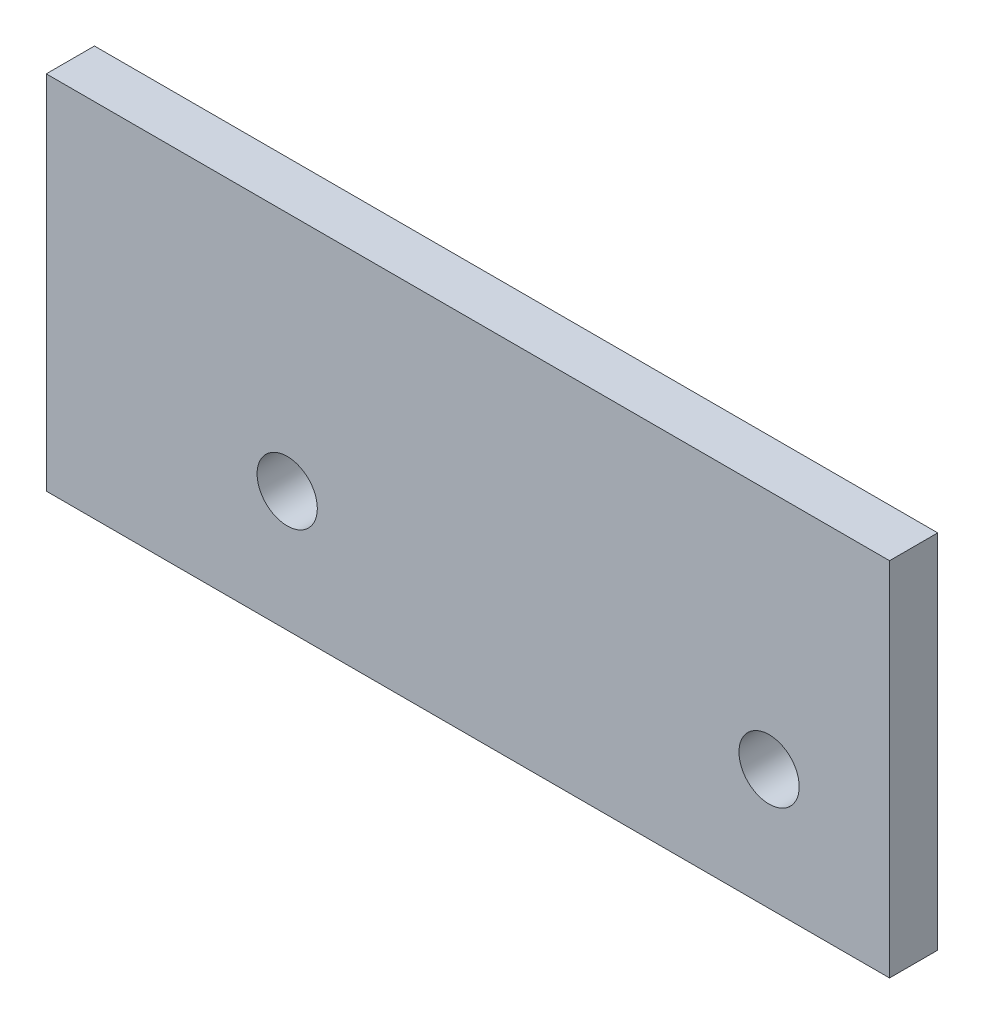
ISO-10303-21;
HEADER;
FILE_DESCRIPTION(('STEP AP214'),'2;1');
FILE_NAME('part.step','',(''),(''),'','','');
FILE_SCHEMA(('AUTOMOTIVE_DESIGN { 1 0 10303 214 1 1 1 1 }'));
ENDSEC;
DATA;
#1=APPLICATION_CONTEXT('core data for automotive mechanical design processes');
#2=APPLICATION_PROTOCOL_DEFINITION('international standard','automotive_design',2000,#1);
#3=PRODUCT_CONTEXT('',#1,'mechanical');
#4=PRODUCT('Part','Part','',(#3));
#5=PRODUCT_RELATED_PRODUCT_CATEGORY('part','',(#4));
#6=PRODUCT_DEFINITION_FORMATION('','',#4);
#7=PRODUCT_DEFINITION_CONTEXT('part definition',#1,'design');
#8=PRODUCT_DEFINITION('design','',#6,#7);
#9=PRODUCT_DEFINITION_SHAPE('','',#8);
#10=(LENGTH_UNIT() NAMED_UNIT(*) SI_UNIT(.MILLI.,.METRE.));
#11=(NAMED_UNIT(*) PLANE_ANGLE_UNIT() SI_UNIT($,.RADIAN.));
#12=(NAMED_UNIT(*) SI_UNIT($,.STERADIAN.) SOLID_ANGLE_UNIT());
#13=UNCERTAINTY_MEASURE_WITH_UNIT(LENGTH_MEASURE(1.E-05),#10,'distance_accuracy_value','');
#14=(GEOMETRIC_REPRESENTATION_CONTEXT(3) GLOBAL_UNCERTAINTY_ASSIGNED_CONTEXT((#13)) GLOBAL_UNIT_ASSIGNED_CONTEXT((#10,
#11,#12)) REPRESENTATION_CONTEXT('',''));
#15=CARTESIAN_POINT('',(0.,0.,0.));
#16=DIRECTION('',(0.,0.,1.));
#17=DIRECTION('',(1.,0.,0.));
#18=AXIS2_PLACEMENT_3D('',#15,#16,#17);
#19=CARTESIAN_POINT('',(50.,0.,-4.));
#20=DIRECTION('',(-1.,0.,0.));
#21=DIRECTION('',(0.,0.,1.));
#22=AXIS2_PLACEMENT_3D('',#19,#20,#21);
#23=PLANE('',#22);
#24=DIRECTION('',(0.,-1.,0.));
#25=VECTOR('',#24,1.);
#26=CARTESIAN_POINT('',(50.,0.,0.));
#27=LINE('',#26,#25);
#28=CARTESIAN_POINT('',(50.,20.,0.));
#29=VERTEX_POINT('',#28);
#30=CARTESIAN_POINT('',(50.,-10.,0.));
#31=VERTEX_POINT('',#30);
#32=EDGE_CURVE('E120',#29,#31,#27,.T.);
#33=ORIENTED_EDGE('',*,*,#32,.T.);
#34=DIRECTION('',(0.,0.,1.));
#35=VECTOR('',#34,1.);
#36=CARTESIAN_POINT('',(50.,-10.,-4.));
#37=LINE('',#36,#35);
#38=CARTESIAN_POINT('',(50.,-10.,-4.));
#39=VERTEX_POINT('',#38);
#40=EDGE_CURVE('E86',#39,#31,#37,.T.);
#41=ORIENTED_EDGE('',*,*,#40,.F.);
#42=DIRECTION('',(0.,-1.,0.));
#43=VECTOR('',#42,1.);
#44=CARTESIAN_POINT('',(50.,0.,-4.));
#45=LINE('',#44,#43);
#46=CARTESIAN_POINT('',(50.,20.,-4.));
#47=VERTEX_POINT('',#46);
#48=EDGE_CURVE('E62',#47,#39,#45,.T.);
#49=ORIENTED_EDGE('',*,*,#48,.F.);
#50=DIRECTION('',(0.,0.,1.));
#51=VECTOR('',#50,1.);
#52=CARTESIAN_POINT('',(50.,20.,-4.));
#53=LINE('',#52,#51);
#54=EDGE_CURVE('E101',#47,#29,#53,.T.);
#55=ORIENTED_EDGE('',*,*,#54,.T.);
#56=EDGE_LOOP('',(#33,#41,#49,#55));
#57=FACE_BOUND('',#56,.T.);
#58=ADVANCED_FACE('F43',(#57),#23,.F.);
#59=CARTESIAN_POINT('',(0.,-10.,-4.));
#60=DIRECTION('',(0.,-1.,0.));
#61=DIRECTION('',(0.,0.,-1.));
#62=AXIS2_PLACEMENT_3D('',#59,#60,#61);
#63=PLANE('',#62);
#64=DIRECTION('',(1.,0.,0.));
#65=VECTOR('',#64,1.);
#66=CARTESIAN_POINT('',(0.,-10.,0.));
#67=LINE('',#66,#65);
#68=CARTESIAN_POINT('',(-20.,-10.,0.));
#69=VERTEX_POINT('',#68);
#70=EDGE_CURVE('E129',#69,#31,#67,.T.);
#71=ORIENTED_EDGE('',*,*,#70,.F.);
#72=DIRECTION('',(0.,0.,1.));
#73=VECTOR('',#72,1.);
#74=CARTESIAN_POINT('',(-20.,-10.,-4.));
#75=LINE('',#74,#73);
#76=CARTESIAN_POINT('',(-20.,-10.,-4.));
#77=VERTEX_POINT('',#76);
#78=EDGE_CURVE('E79',#77,#69,#75,.T.);
#79=ORIENTED_EDGE('',*,*,#78,.F.);
#80=DIRECTION('',(1.,0.,0.));
#81=VECTOR('',#80,1.);
#82=CARTESIAN_POINT('',(0.,-10.,-4.));
#83=LINE('',#82,#81);
#84=EDGE_CURVE('E109',#77,#39,#83,.T.);
#85=ORIENTED_EDGE('',*,*,#84,.T.);
#86=ORIENTED_EDGE('',*,*,#40,.T.);
#87=EDGE_LOOP('',(#71,#79,#85,#86));
#88=FACE_BOUND('',#87,.T.);
#89=ADVANCED_FACE('F158',(#88),#63,.T.);
#90=CARTESIAN_POINT('',(-20.,0.,-4.));
#91=DIRECTION('',(-1.,0.,0.));
#92=DIRECTION('',(0.,0.,1.));
#93=AXIS2_PLACEMENT_3D('',#90,#91,#92);
#94=PLANE('',#93);
#95=DIRECTION('',(0.,-1.,0.));
#96=VECTOR('',#95,1.);
#97=CARTESIAN_POINT('',(-20.,0.,0.));
#98=LINE('',#97,#96);
#99=CARTESIAN_POINT('',(-20.,20.,0.));
#100=VERTEX_POINT('',#99);
#101=EDGE_CURVE('E97',#100,#69,#98,.T.);
#102=ORIENTED_EDGE('',*,*,#101,.F.);
#103=DIRECTION('',(0.,0.,1.));
#104=VECTOR('',#103,1.);
#105=CARTESIAN_POINT('',(-20.,20.,-4.));
#106=LINE('',#105,#104);
#107=CARTESIAN_POINT('',(-20.,20.,-4.));
#108=VERTEX_POINT('',#107);
#109=EDGE_CURVE('E94',#108,#100,#106,.T.);
#110=ORIENTED_EDGE('',*,*,#109,.F.);
#111=DIRECTION('',(0.,-1.,0.));
#112=VECTOR('',#111,1.);
#113=CARTESIAN_POINT('',(-20.,0.,-4.));
#114=LINE('',#113,#112);
#115=EDGE_CURVE('E96',#108,#77,#114,.T.);
#116=ORIENTED_EDGE('',*,*,#115,.T.);
#117=ORIENTED_EDGE('',*,*,#78,.T.);
#118=EDGE_LOOP('',(#102,#110,#116,#117));
#119=FACE_BOUND('',#118,.T.);
#120=ADVANCED_FACE('F95',(#119),#94,.T.);
#121=CARTESIAN_POINT('',(0.,20.,-4.));
#122=DIRECTION('',(0.,-1.,0.));
#123=DIRECTION('',(0.,0.,-1.));
#124=AXIS2_PLACEMENT_3D('',#121,#122,#123);
#125=PLANE('',#124);
#126=DIRECTION('',(1.,0.,0.));
#127=VECTOR('',#126,1.);
#128=CARTESIAN_POINT('',(0.,20.,0.));
#129=LINE('',#128,#127);
#130=EDGE_CURVE('E123',#100,#29,#129,.T.);
#131=ORIENTED_EDGE('',*,*,#130,.T.);
#132=ORIENTED_EDGE('',*,*,#54,.F.);
#133=DIRECTION('',(1.,0.,0.));
#134=VECTOR('',#133,1.);
#135=CARTESIAN_POINT('',(0.,20.,-4.));
#136=LINE('',#135,#134);
#137=EDGE_CURVE('E91',#108,#47,#136,.T.);
#138=ORIENTED_EDGE('',*,*,#137,.F.);
#139=ORIENTED_EDGE('',*,*,#109,.T.);
#140=EDGE_LOOP('',(#131,#132,#138,#139));
#141=FACE_BOUND('',#140,.T.);
#142=ADVANCED_FACE('F103',(#141),#125,.F.);
#143=CARTESIAN_POINT('',(40.,0.,-4.));
#144=DIRECTION('',(0.,0.,1.));
#145=DIRECTION('',(1.,0.,0.));
#146=AXIS2_PLACEMENT_3D('',#143,#144,#145);
#147=CYLINDRICAL_SURFACE('',#146,2.50000000000001);
#148=CARTESIAN_POINT('',(40.,0.,-4.));
#149=DIRECTION('',(0.,0.,1.));
#150=DIRECTION('',(1.,0.,0.));
#151=AXIS2_PLACEMENT_3D('',#148,#149,#150);
#152=CIRCLE('',#151,2.50000000000001);
#153=CARTESIAN_POINT('',(42.5,0.,-4.));
#154=VERTEX_POINT('',#153);
#155=EDGE_CURVE('E113',#154,#154,#152,.T.);
#156=ORIENTED_EDGE('',*,*,#155,.F.);
#157=EDGE_LOOP('',(#156));
#158=FACE_BOUND('',#157,.T.);
#159=CARTESIAN_POINT('',(40.,0.,0.));
#160=DIRECTION('',(0.,0.,1.));
#161=DIRECTION('',(1.,0.,0.));
#162=AXIS2_PLACEMENT_3D('',#159,#160,#161);
#163=CIRCLE('',#162,2.50000000000001);
#164=CARTESIAN_POINT('',(42.5,0.,0.));
#165=VERTEX_POINT('',#164);
#166=EDGE_CURVE('E133',#165,#165,#163,.T.);
#167=ORIENTED_EDGE('',*,*,#166,.T.);
#168=EDGE_LOOP('',(#167));
#169=FACE_BOUND('',#168,.T.);
#170=ADVANCED_FACE('F167',(#158,#169),#147,.F.);
#171=CARTESIAN_POINT('',(0.,0.,-4.));
#172=DIRECTION('',(0.,0.,1.));
#173=DIRECTION('',(1.,0.,0.));
#174=AXIS2_PLACEMENT_3D('',#171,#172,#173);
#175=PLANE('',#174);
#176=CARTESIAN_POINT('',(0.,0.,-4.));
#177=DIRECTION('',(0.,0.,1.));
#178=DIRECTION('',(1.,0.,0.));
#179=AXIS2_PLACEMENT_3D('',#176,#177,#178);
#180=CIRCLE('',#179,9.00000000000004);
#181=CARTESIAN_POINT('',(9.00000000000004,0.,-4.));
#182=VERTEX_POINT('',#181);
#183=EDGE_CURVE('E54',#182,#182,#180,.T.);
#184=ORIENTED_EDGE('',*,*,#183,.T.);
#185=EDGE_LOOP('',(#184));
#186=FACE_BOUND('',#185,.T.);
#187=ORIENTED_EDGE('',*,*,#48,.T.);
#188=ORIENTED_EDGE('',*,*,#84,.F.);
#189=ORIENTED_EDGE('',*,*,#115,.F.);
#190=ORIENTED_EDGE('',*,*,#137,.T.);
#191=EDGE_LOOP('',(#187,#188,#189,#190));
#192=FACE_BOUND('',#191,.T.);
#193=ORIENTED_EDGE('',*,*,#155,.T.);
#194=EDGE_LOOP('',(#193));
#195=FACE_BOUND('',#194,.T.);
#196=ADVANCED_FACE('F107',(#186,#192,#195),#175,.F.);
#197=CARTESIAN_POINT('',(0.,0.,0.));
#198=DIRECTION('',(0.,0.,1.));
#199=DIRECTION('',(1.,0.,0.));
#200=AXIS2_PLACEMENT_3D('',#197,#198,#199);
#201=PLANE('',#200);
#202=ORIENTED_EDGE('',*,*,#32,.F.);
#203=ORIENTED_EDGE('',*,*,#130,.F.);
#204=ORIENTED_EDGE('',*,*,#101,.T.);
#205=ORIENTED_EDGE('',*,*,#70,.T.);
#206=EDGE_LOOP('',(#202,#203,#204,#205));
#207=FACE_BOUND('',#206,.T.);
#208=ORIENTED_EDGE('',*,*,#166,.F.);
#209=EDGE_LOOP('',(#208));
#210=FACE_BOUND('',#209,.T.);
#211=CARTESIAN_POINT('',(0.,0.,0.));
#212=DIRECTION('',(0.,0.,1.));
#213=DIRECTION('',(1.,0.,0.));
#214=AXIS2_PLACEMENT_3D('',#211,#212,#213);
#215=CIRCLE('',#214,2.5);
#216=CARTESIAN_POINT('',(2.5,0.,0.));
#217=VERTEX_POINT('',#216);
#218=EDGE_CURVE('E196',#217,#217,#215,.T.);
#219=ORIENTED_EDGE('',*,*,#218,.F.);
#220=EDGE_LOOP('',(#219));
#221=FACE_BOUND('',#220,.T.);
#222=ADVANCED_FACE('F173',(#207,#210,#221),#201,.T.);
#223=CARTESIAN_POINT('',(0.,0.,-16.063));
#224=DIRECTION('',(0.,0.,1.));
#225=DIRECTION('',(1.,0.,0.));
#226=AXIS2_PLACEMENT_3D('',#223,#224,#225);
#227=CYLINDRICAL_SURFACE('',#226,4.);
#228=CARTESIAN_POINT('',(0.,0.,-9.00000000000009));
#229=DIRECTION('',(0.,0.,1.));
#230=DIRECTION('',(1.,0.,0.));
#231=AXIS2_PLACEMENT_3D('',#228,#229,#230);
#232=CIRCLE('',#231,4.);
#233=CARTESIAN_POINT('',(4.,0.,-9.00000000000009));
#234=VERTEX_POINT('',#233);
#235=EDGE_CURVE('E11',#234,#234,#232,.F.);
#236=ORIENTED_EDGE('',*,*,#235,.T.);
#237=EDGE_LOOP('',(#236));
#238=FACE_BOUND('',#237,.T.);
#239=CARTESIAN_POINT('',(0.,0.,-16.063));
#240=DIRECTION('',(0.,0.,1.));
#241=DIRECTION('',(1.,0.,0.));
#242=AXIS2_PLACEMENT_3D('',#239,#240,#241);
#243=CIRCLE('',#242,4.);
#244=CARTESIAN_POINT('',(4.,0.,-16.063));
#245=VERTEX_POINT('',#244);
#246=EDGE_CURVE('E124',#245,#245,#243,.T.);
#247=ORIENTED_EDGE('',*,*,#246,.T.);
#248=EDGE_LOOP('',(#247));
#249=FACE_BOUND('',#248,.T.);
#250=ADVANCED_FACE('F176',(#238,#249),#227,.T.);
#251=CARTESIAN_POINT('',(0.,0.,-16.063));
#252=DIRECTION('',(0.,0.,1.));
#253=DIRECTION('',(1.,0.,0.));
#254=AXIS2_PLACEMENT_3D('',#251,#252,#253);
#255=CYLINDRICAL_SURFACE('',#254,2.5);
#256=CARTESIAN_POINT('',(0.,0.,-16.063));
#257=DIRECTION('',(0.,0.,1.));
#258=DIRECTION('',(1.,0.,0.));
#259=AXIS2_PLACEMENT_3D('',#256,#257,#258);
#260=CIRCLE('',#259,2.5);
#261=CARTESIAN_POINT('',(2.5,0.,-16.063));
#262=VERTEX_POINT('',#261);
#263=EDGE_CURVE('E192',#262,#262,#260,.T.);
#264=ORIENTED_EDGE('',*,*,#263,.F.);
#265=EDGE_LOOP('',(#264));
#266=FACE_BOUND('',#265,.T.);
#267=ORIENTED_EDGE('',*,*,#218,.T.);
#268=EDGE_LOOP('',(#267));
#269=FACE_BOUND('',#268,.T.);
#270=ADVANCED_FACE('F153',(#266,#269),#255,.F.);
#271=CARTESIAN_POINT('',(0.,0.,-16.063));
#272=DIRECTION('',(0.,0.,1.));
#273=DIRECTION('',(1.,0.,0.));
#274=AXIS2_PLACEMENT_3D('',#271,#272,#273);
#275=PLANE('',#274);
#276=ORIENTED_EDGE('',*,*,#263,.T.);
#277=EDGE_LOOP('',(#276));
#278=FACE_BOUND('',#277,.T.);
#279=ORIENTED_EDGE('',*,*,#246,.F.);
#280=EDGE_LOOP('',(#279));
#281=FACE_BOUND('',#280,.T.);
#282=ADVANCED_FACE('F148',(#278,#281),#275,.F.);
#283=CARTESIAN_POINT('',(0.,0.,-4.));
#284=DIRECTION('',(0.,0.,1.));
#285=DIRECTION('',(1.,0.,0.));
#286=AXIS2_PLACEMENT_3D('',#283,#284,#285);
#287=CONICAL_SURFACE('',#286,9.00000000000004,0.785398163397443);
#288=ORIENTED_EDGE('',*,*,#235,.F.);
#289=EDGE_LOOP('',(#288));
#290=FACE_BOUND('',#289,.T.);
#291=ORIENTED_EDGE('',*,*,#183,.F.);
#292=EDGE_LOOP('',(#291));
#293=FACE_BOUND('',#292,.T.);
#294=ADVANCED_FACE('F46',(#290,#293),#287,.T.);
#295=CLOSED_SHELL('',(#58,#89,#120,#142,#170,#196,#222,#250,#270,#282,#294));
#296=MANIFOLD_SOLID_BREP('B2',#295);
#297=ADVANCED_BREP_SHAPE_REPRESENTATION('',(#18,#296),#14);
#298=SHAPE_DEFINITION_REPRESENTATION(#9,#297);
ENDSEC;
END-ISO-10303-21;
